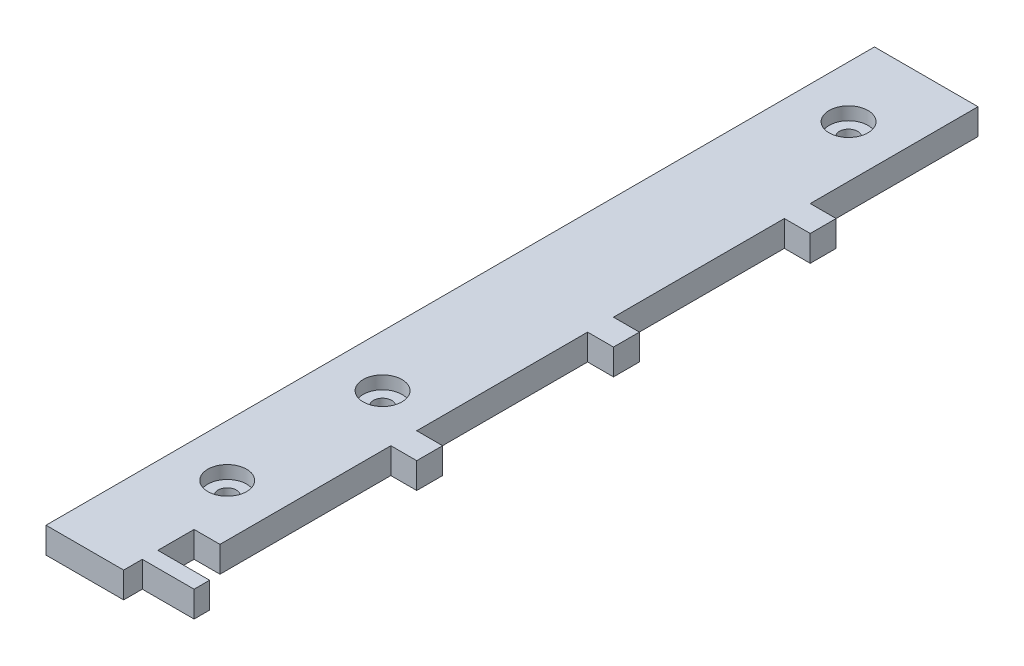
ISO-10303-21;
HEADER;
FILE_DESCRIPTION(('STEP AP214'),'2;1');
FILE_NAME('part.step','',(''),(''),'','','');
FILE_SCHEMA(('AUTOMOTIVE_DESIGN { 1 0 10303 214 1 1 1 1 }'));
ENDSEC;
DATA;
#1=APPLICATION_CONTEXT('core data for automotive mechanical design processes');
#2=APPLICATION_PROTOCOL_DEFINITION('international standard','automotive_design',2000,#1);
#3=PRODUCT_CONTEXT('',#1,'mechanical');
#4=PRODUCT('Part','Part','',(#3));
#5=PRODUCT_RELATED_PRODUCT_CATEGORY('part','',(#4));
#6=PRODUCT_DEFINITION_FORMATION('','',#4);
#7=PRODUCT_DEFINITION_CONTEXT('part definition',#1,'design');
#8=PRODUCT_DEFINITION('design','',#6,#7);
#9=PRODUCT_DEFINITION_SHAPE('','',#8);
#10=(LENGTH_UNIT() NAMED_UNIT(*) SI_UNIT(.MILLI.,.METRE.));
#11=(NAMED_UNIT(*) PLANE_ANGLE_UNIT() SI_UNIT($,.RADIAN.));
#12=(NAMED_UNIT(*) SI_UNIT($,.STERADIAN.) SOLID_ANGLE_UNIT());
#13=UNCERTAINTY_MEASURE_WITH_UNIT(LENGTH_MEASURE(1.E-05),#10,'distance_accuracy_value','');
#14=(GEOMETRIC_REPRESENTATION_CONTEXT(3) GLOBAL_UNCERTAINTY_ASSIGNED_CONTEXT((#13)) GLOBAL_UNIT_ASSIGNED_CONTEXT((#10,
#11,#12)) REPRESENTATION_CONTEXT('',''));
#15=CARTESIAN_POINT('',(0.,0.,0.));
#16=DIRECTION('',(0.,0.,1.));
#17=DIRECTION('',(1.,0.,0.));
#18=AXIS2_PLACEMENT_3D('',#15,#16,#17);
#19=CARTESIAN_POINT('',(0.,6.35,0.));
#20=DIRECTION('',(0.,-1.,0.));
#21=DIRECTION('',(0.,0.,-1.));
#22=AXIS2_PLACEMENT_3D('',#19,#20,#21);
#23=PLANE('',#22);
#24=CARTESIAN_POINT('',(12.7,6.35,-31.75));
#25=DIRECTION('',(0.,1.,0.));
#26=DIRECTION('',(0.,0.,1.));
#27=AXIS2_PLACEMENT_3D('',#24,#25,#26);
#28=CIRCLE('',#27,4.76249999999999);
#29=CARTESIAN_POINT('',(12.7,6.35,-26.9875));
#30=VERTEX_POINT('',#29);
#31=EDGE_CURVE('E387',#30,#30,#28,.T.);
#32=ORIENTED_EDGE('',*,*,#31,.F.);
#33=EDGE_LOOP('',(#32));
#34=FACE_BOUND('',#33,.T.);
#35=CARTESIAN_POINT('',(12.7,6.35,-69.85));
#36=DIRECTION('',(0.,1.,0.));
#37=DIRECTION('',(0.,0.,1.));
#38=AXIS2_PLACEMENT_3D('',#35,#36,#37);
#39=CIRCLE('',#38,4.76249999999999);
#40=CARTESIAN_POINT('',(12.7,6.35,-65.0875));
#41=VERTEX_POINT('',#40);
#42=EDGE_CURVE('E375',#41,#41,#39,.T.);
#43=ORIENTED_EDGE('',*,*,#42,.F.);
#44=EDGE_LOOP('',(#43));
#45=FACE_BOUND('',#44,.T.);
#46=DIRECTION('',(0.,0.,-1.));
#47=VECTOR('',#46,1.);
#48=CARTESIAN_POINT('',(19.05,6.35,0.));
#49=LINE('',#48,#47);
#50=CARTESIAN_POINT('',(19.05,6.35,0.));
#51=VERTEX_POINT('',#50);
#52=CARTESIAN_POINT('',(19.05,6.35,-4.572));
#53=VERTEX_POINT('',#52);
#54=EDGE_CURVE('E188',#51,#53,#49,.T.);
#55=ORIENTED_EDGE('',*,*,#54,.T.);
#56=DIRECTION('',(-1.,0.,0.));
#57=VECTOR('',#56,1.);
#58=CARTESIAN_POINT('',(0.,6.35,-4.572));
#59=LINE('',#58,#57);
#60=CARTESIAN_POINT('',(31.75,6.35,-4.572));
#61=VERTEX_POINT('',#60);
#62=EDGE_CURVE('E200',#61,#53,#59,.T.);
#63=ORIENTED_EDGE('',*,*,#62,.F.);
#64=DIRECTION('',(0.,0.,-1.));
#65=VECTOR('',#64,1.);
#66=CARTESIAN_POINT('',(31.75,6.35,0.));
#67=LINE('',#66,#65);
#68=CARTESIAN_POINT('',(31.75,6.35,-8.382));
#69=VERTEX_POINT('',#68);
#70=EDGE_CURVE('E222',#61,#69,#67,.T.);
#71=ORIENTED_EDGE('',*,*,#70,.T.);
#72=DIRECTION('',(-1.,0.,0.));
#73=VECTOR('',#72,1.);
#74=CARTESIAN_POINT('',(31.75,6.35,-8.382));
#75=LINE('',#74,#73);
#76=CARTESIAN_POINT('',(19.05,6.35,-8.382));
#77=VERTEX_POINT('',#76);
#78=EDGE_CURVE('E260',#69,#77,#75,.T.);
#79=ORIENTED_EDGE('',*,*,#78,.T.);
#80=DIRECTION('',(0.,0.,-1.));
#81=VECTOR('',#80,1.);
#82=CARTESIAN_POINT('',(19.05,6.35,-8.382));
#83=LINE('',#82,#81);
#84=CARTESIAN_POINT('',(19.05,6.35,-17.272));
#85=VERTEX_POINT('',#84);
#86=EDGE_CURVE('E270',#77,#85,#83,.T.);
#87=ORIENTED_EDGE('',*,*,#86,.T.);
#88=DIRECTION('',(-1.,0.,0.));
#89=VECTOR('',#88,1.);
#90=CARTESIAN_POINT('',(31.75,6.35,-17.272));
#91=LINE('',#90,#89);
#92=CARTESIAN_POINT('',(25.4,6.35,-17.272));
#93=VERTEX_POINT('',#92);
#94=EDGE_CURVE('E267',#93,#85,#91,.T.);
#95=ORIENTED_EDGE('',*,*,#94,.F.);
#96=DIRECTION('',(0.,0.,1.));
#97=VECTOR('',#96,1.);
#98=CARTESIAN_POINT('',(25.4,6.35,0.));
#99=LINE('',#98,#97);
#100=CARTESIAN_POINT('',(25.4,6.35,-59.182));
#101=VERTEX_POINT('',#100);
#102=EDGE_CURVE('E240',#101,#93,#99,.T.);
#103=ORIENTED_EDGE('',*,*,#102,.F.);
#104=DIRECTION('',(-1.,0.,0.));
#105=VECTOR('',#104,1.);
#106=CARTESIAN_POINT('',(0.,6.35,-59.182));
#107=LINE('',#106,#105);
#108=CARTESIAN_POINT('',(31.75,6.35,-59.182));
#109=VERTEX_POINT('',#108);
#110=EDGE_CURVE('E245',#109,#101,#107,.T.);
#111=ORIENTED_EDGE('',*,*,#110,.F.);
#112=CARTESIAN_POINT('',(31.75,6.35,-65.532));
#113=VERTEX_POINT('',#112);
#114=EDGE_CURVE('E228',#109,#113,#67,.T.);
#115=ORIENTED_EDGE('',*,*,#114,.T.);
#116=DIRECTION('',(-1.,0.,0.));
#117=VECTOR('',#116,1.);
#118=CARTESIAN_POINT('',(0.,6.35,-65.532));
#119=LINE('',#118,#117);
#120=CARTESIAN_POINT('',(25.4,6.35,-65.532));
#121=VERTEX_POINT('',#120);
#122=EDGE_CURVE('E284',#113,#121,#119,.T.);
#123=ORIENTED_EDGE('',*,*,#122,.T.);
#124=DIRECTION('',(0.,0.,1.));
#125=VECTOR('',#124,1.);
#126=CARTESIAN_POINT('',(25.4,6.35,0.));
#127=LINE('',#126,#125);
#128=CARTESIAN_POINT('',(25.4,6.35,-107.442));
#129=VERTEX_POINT('',#128);
#130=EDGE_CURVE('E296',#129,#121,#127,.T.);
#131=ORIENTED_EDGE('',*,*,#130,.F.);
#132=DIRECTION('',(-1.,0.,0.));
#133=VECTOR('',#132,1.);
#134=CARTESIAN_POINT('',(0.,6.35,-107.442));
#135=LINE('',#134,#133);
#136=CARTESIAN_POINT('',(31.75,6.35,-107.442));
#137=VERTEX_POINT('',#136);
#138=EDGE_CURVE('E292',#137,#129,#135,.T.);
#139=ORIENTED_EDGE('',*,*,#138,.F.);
#140=CARTESIAN_POINT('',(31.75,6.35,-113.792));
#141=VERTEX_POINT('',#140);
#142=EDGE_CURVE('E233',#137,#141,#67,.T.);
#143=ORIENTED_EDGE('',*,*,#142,.T.);
#144=DIRECTION('',(-1.,0.,0.));
#145=VECTOR('',#144,1.);
#146=CARTESIAN_POINT('',(31.75,6.35,-113.792));
#147=LINE('',#146,#145);
#148=CARTESIAN_POINT('',(25.4,6.35,-113.792));
#149=VERTEX_POINT('',#148);
#150=EDGE_CURVE('E330',#141,#149,#147,.T.);
#151=ORIENTED_EDGE('',*,*,#150,.T.);
#152=DIRECTION('',(0.,0.,1.));
#153=VECTOR('',#152,1.);
#154=CARTESIAN_POINT('',(25.4,6.35,-155.702));
#155=LINE('',#154,#153);
#156=CARTESIAN_POINT('',(25.4,6.35,-155.702));
#157=VERTEX_POINT('',#156);
#158=EDGE_CURVE('E340',#157,#149,#155,.T.);
#159=ORIENTED_EDGE('',*,*,#158,.F.);
#160=DIRECTION('',(-1.,0.,0.));
#161=VECTOR('',#160,1.);
#162=CARTESIAN_POINT('',(31.75,6.35,-155.702));
#163=LINE('',#162,#161);
#164=CARTESIAN_POINT('',(31.75,6.35,-155.702));
#165=VERTEX_POINT('',#164);
#166=EDGE_CURVE('E337',#165,#157,#163,.T.);
#167=ORIENTED_EDGE('',*,*,#166,.F.);
#168=CARTESIAN_POINT('',(31.75,6.35,-162.052));
#169=VERTEX_POINT('',#168);
#170=EDGE_CURVE('E230',#165,#169,#67,.T.);
#171=ORIENTED_EDGE('',*,*,#170,.T.);
#172=DIRECTION('',(-1.,0.,0.));
#173=VECTOR('',#172,1.);
#174=CARTESIAN_POINT('',(0.,6.35,-162.052));
#175=LINE('',#174,#173);
#176=CARTESIAN_POINT('',(25.4,6.35,-162.052));
#177=VERTEX_POINT('',#176);
#178=EDGE_CURVE('E311',#169,#177,#175,.T.);
#179=ORIENTED_EDGE('',*,*,#178,.T.);
#180=DIRECTION('',(0.,0.,1.));
#181=VECTOR('',#180,1.);
#182=CARTESIAN_POINT('',(25.4,6.35,0.));
#183=LINE('',#182,#181);
#184=CARTESIAN_POINT('',(25.4,6.35,-203.2));
#185=VERTEX_POINT('',#184);
#186=EDGE_CURVE('E316',#185,#177,#183,.T.);
#187=ORIENTED_EDGE('',*,*,#186,.F.);
#188=DIRECTION('',(-1.,0.,0.));
#189=VECTOR('',#188,1.);
#190=CARTESIAN_POINT('',(0.,6.35,-203.2));
#191=LINE('',#190,#189);
#192=CARTESIAN_POINT('',(0.,6.35,-203.2));
#193=VERTEX_POINT('',#192);
#194=EDGE_CURVE('E218',#185,#193,#191,.T.);
#195=ORIENTED_EDGE('',*,*,#194,.T.);
#196=DIRECTION('',(0.,0.,1.));
#197=VECTOR('',#196,1.);
#198=CARTESIAN_POINT('',(0.,6.35,0.));
#199=LINE('',#198,#197);
#200=CARTESIAN_POINT('',(0.,6.35,0.));
#201=VERTEX_POINT('',#200);
#202=EDGE_CURVE('E216',#193,#201,#199,.T.);
#203=ORIENTED_EDGE('',*,*,#202,.T.);
#204=DIRECTION('',(1.,0.,0.));
#205=VECTOR('',#204,1.);
#206=CARTESIAN_POINT('',(0.,6.35,0.));
#207=LINE('',#206,#205);
#208=EDGE_CURVE('E234',#201,#51,#207,.T.);
#209=ORIENTED_EDGE('',*,*,#208,.T.);
#210=EDGE_LOOP('',(#55,#63,#71,#79,#87,#95,#103,#111,#115,#123,#131,#139,#143,#151,#159,#167,
#171,#179,#187,#195,#203,#209));
#211=FACE_BOUND('',#210,.T.);
#212=CARTESIAN_POINT('',(12.7,6.35,-184.15));
#213=DIRECTION('',(0.,1.,0.));
#214=DIRECTION('',(0.,0.,1.));
#215=AXIS2_PLACEMENT_3D('',#212,#213,#214);
#216=CIRCLE('',#215,4.76249999999999);
#217=CARTESIAN_POINT('',(12.7,6.35,-179.3875));
#218=VERTEX_POINT('',#217);
#219=EDGE_CURVE('E363',#218,#218,#216,.T.);
#220=ORIENTED_EDGE('',*,*,#219,.F.);
#221=EDGE_LOOP('',(#220));
#222=FACE_BOUND('',#221,.T.);
#223=ADVANCED_FACE('F33',(#34,#45,#211,#222),#23,.F.);
#224=CARTESIAN_POINT('',(0.,6.35,0.));
#225=DIRECTION('',(0.,0.,-1.));
#226=DIRECTION('',(-1.,0.,0.));
#227=AXIS2_PLACEMENT_3D('',#224,#225,#226);
#228=PLANE('',#227);
#229=DIRECTION('',(0.,1.,0.));
#230=VECTOR('',#229,1.);
#231=CARTESIAN_POINT('',(19.05,0.,0.));
#232=LINE('',#231,#230);
#233=CARTESIAN_POINT('',(19.05,0.,0.));
#234=VERTEX_POINT('',#233);
#235=EDGE_CURVE('E182',#234,#51,#232,.T.);
#236=ORIENTED_EDGE('',*,*,#235,.T.);
#237=ORIENTED_EDGE('',*,*,#208,.F.);
#238=DIRECTION('',(0.,-1.,0.));
#239=VECTOR('',#238,1.);
#240=CARTESIAN_POINT('',(0.,6.35,0.));
#241=LINE('',#240,#239);
#242=CARTESIAN_POINT('',(0.,0.,0.));
#243=VERTEX_POINT('',#242);
#244=EDGE_CURVE('E11',#201,#243,#241,.T.);
#245=ORIENTED_EDGE('',*,*,#244,.T.);
#246=DIRECTION('',(1.,0.,0.));
#247=VECTOR('',#246,1.);
#248=CARTESIAN_POINT('',(0.,0.,0.));
#249=LINE('',#248,#247);
#250=EDGE_CURVE('E198',#243,#234,#249,.T.);
#251=ORIENTED_EDGE('',*,*,#250,.T.);
#252=EDGE_LOOP('',(#236,#237,#245,#251));
#253=FACE_BOUND('',#252,.T.);
#254=ADVANCED_FACE('F202',(#253),#228,.F.);
#255=CARTESIAN_POINT('',(31.75,6.35,0.));
#256=DIRECTION('',(-1.,0.,0.));
#257=DIRECTION('',(0.,0.,1.));
#258=AXIS2_PLACEMENT_3D('',#255,#256,#257);
#259=PLANE('',#258);
#260=DIRECTION('',(0.,1.,0.));
#261=VECTOR('',#260,1.);
#262=CARTESIAN_POINT('',(31.75,0.,-113.792));
#263=LINE('',#262,#261);
#264=CARTESIAN_POINT('',(31.75,0.,-113.792));
#265=VERTEX_POINT('',#264);
#266=EDGE_CURVE('E345',#265,#141,#263,.T.);
#267=ORIENTED_EDGE('',*,*,#266,.T.);
#268=ORIENTED_EDGE('',*,*,#142,.F.);
#269=DIRECTION('',(0.,1.,0.));
#270=VECTOR('',#269,1.);
#271=CARTESIAN_POINT('',(31.75,0.,-107.442));
#272=LINE('',#271,#270);
#273=CARTESIAN_POINT('',(31.75,0.,-107.442));
#274=VERTEX_POINT('',#273);
#275=EDGE_CURVE('E269',#274,#137,#272,.T.);
#276=ORIENTED_EDGE('',*,*,#275,.F.);
#277=DIRECTION('',(0.,0.,-1.));
#278=VECTOR('',#277,1.);
#279=CARTESIAN_POINT('',(31.75,0.,0.));
#280=LINE('',#279,#278);
#281=EDGE_CURVE('E209',#274,#265,#280,.T.);
#282=ORIENTED_EDGE('',*,*,#281,.T.);
#283=EDGE_LOOP('',(#267,#268,#276,#282));
#284=FACE_BOUND('',#283,.T.);
#285=ADVANCED_FACE('F487',(#284),#259,.F.);
#286=ORIENTED_EDGE('',*,*,#170,.F.);
#287=DIRECTION('',(0.,1.,0.));
#288=VECTOR('',#287,1.);
#289=CARTESIAN_POINT('',(31.75,0.,-155.702));
#290=LINE('',#289,#288);
#291=CARTESIAN_POINT('',(31.75,0.,-155.702));
#292=VERTEX_POINT('',#291);
#293=EDGE_CURVE('E319',#292,#165,#290,.T.);
#294=ORIENTED_EDGE('',*,*,#293,.F.);
#295=CARTESIAN_POINT('',(31.75,0.,-162.052));
#296=VERTEX_POINT('',#295);
#297=EDGE_CURVE('E205',#292,#296,#280,.T.);
#298=ORIENTED_EDGE('',*,*,#297,.T.);
#299=DIRECTION('',(0.,1.,0.));
#300=VECTOR('',#299,1.);
#301=CARTESIAN_POINT('',(31.75,0.,-162.052));
#302=LINE('',#301,#300);
#303=EDGE_CURVE('E295',#296,#169,#302,.T.);
#304=ORIENTED_EDGE('',*,*,#303,.T.);
#305=EDGE_LOOP('',(#286,#294,#298,#304));
#306=FACE_BOUND('',#305,.T.);
#307=ADVANCED_FACE('F489',(#306),#259,.F.);
#308=DIRECTION('',(0.,1.,0.));
#309=VECTOR('',#308,1.);
#310=CARTESIAN_POINT('',(31.75,0.,-65.532));
#311=LINE('',#310,#309);
#312=CARTESIAN_POINT('',(31.75,0.,-65.532));
#313=VERTEX_POINT('',#312);
#314=EDGE_CURVE('E302',#313,#113,#311,.T.);
#315=ORIENTED_EDGE('',*,*,#314,.T.);
#316=ORIENTED_EDGE('',*,*,#114,.F.);
#317=DIRECTION('',(0.,1.,0.));
#318=VECTOR('',#317,1.);
#319=CARTESIAN_POINT('',(31.75,0.,-59.182));
#320=LINE('',#319,#318);
#321=CARTESIAN_POINT('',(31.75,0.,-59.182));
#322=VERTEX_POINT('',#321);
#323=EDGE_CURVE('E251',#322,#109,#320,.T.);
#324=ORIENTED_EDGE('',*,*,#323,.F.);
#325=EDGE_CURVE('E745',#322,#313,#280,.T.);
#326=ORIENTED_EDGE('',*,*,#325,.T.);
#327=EDGE_LOOP('',(#315,#316,#324,#326));
#328=FACE_BOUND('',#327,.T.);
#329=ADVANCED_FACE('F505',(#328),#259,.F.);
#330=ORIENTED_EDGE('',*,*,#70,.F.);
#331=DIRECTION('',(0.,1.,0.));
#332=VECTOR('',#331,1.);
#333=CARTESIAN_POINT('',(31.75,0.,-4.572));
#334=LINE('',#333,#332);
#335=CARTESIAN_POINT('',(31.75,0.,-4.572));
#336=VERTEX_POINT('',#335);
#337=EDGE_CURVE('E192',#336,#61,#334,.T.);
#338=ORIENTED_EDGE('',*,*,#337,.F.);
#339=CARTESIAN_POINT('',(31.75,0.,-8.382));
#340=VERTEX_POINT('',#339);
#341=EDGE_CURVE('E211',#336,#340,#280,.T.);
#342=ORIENTED_EDGE('',*,*,#341,.T.);
#343=DIRECTION('',(0.,1.,0.));
#344=VECTOR('',#343,1.);
#345=CARTESIAN_POINT('',(31.75,0.,-8.382));
#346=LINE('',#345,#344);
#347=EDGE_CURVE('E248',#340,#69,#346,.T.);
#348=ORIENTED_EDGE('',*,*,#347,.T.);
#349=EDGE_LOOP('',(#330,#338,#342,#348));
#350=FACE_BOUND('',#349,.T.);
#351=ADVANCED_FACE('F482',(#350),#259,.F.);
#352=CARTESIAN_POINT('',(0.,0.,0.));
#353=DIRECTION('',(0.,-1.,0.));
#354=DIRECTION('',(0.,0.,-1.));
#355=AXIS2_PLACEMENT_3D('',#352,#353,#354);
#356=PLANE('',#355);
#357=CARTESIAN_POINT('',(12.7,0.,-31.75));
#358=DIRECTION('',(0.,1.,0.));
#359=DIRECTION('',(0.,0.,1.));
#360=AXIS2_PLACEMENT_3D('',#357,#358,#359);
#361=CIRCLE('',#360,2.24790000000001);
#362=CARTESIAN_POINT('',(12.7,0.,-29.5021));
#363=VERTEX_POINT('',#362);
#364=EDGE_CURVE('E378',#363,#363,#361,.T.);
#365=ORIENTED_EDGE('',*,*,#364,.T.);
#366=EDGE_LOOP('',(#365));
#367=FACE_BOUND('',#366,.T.);
#368=CARTESIAN_POINT('',(12.7,0.,-69.85));
#369=DIRECTION('',(0.,1.,0.));
#370=DIRECTION('',(0.,0.,1.));
#371=AXIS2_PLACEMENT_3D('',#368,#369,#370);
#372=CIRCLE('',#371,2.24790000000001);
#373=CARTESIAN_POINT('',(12.7,0.,-67.6021));
#374=VERTEX_POINT('',#373);
#375=EDGE_CURVE('E366',#374,#374,#372,.T.);
#376=ORIENTED_EDGE('',*,*,#375,.T.);
#377=EDGE_LOOP('',(#376));
#378=FACE_BOUND('',#377,.T.);
#379=CARTESIAN_POINT('',(12.7,0.,-184.15));
#380=DIRECTION('',(0.,1.,0.));
#381=DIRECTION('',(0.,0.,1.));
#382=AXIS2_PLACEMENT_3D('',#379,#380,#381);
#383=CIRCLE('',#382,2.24790000000001);
#384=CARTESIAN_POINT('',(12.7,0.,-181.9021));
#385=VERTEX_POINT('',#384);
#386=EDGE_CURVE('E254',#385,#385,#383,.T.);
#387=ORIENTED_EDGE('',*,*,#386,.T.);
#388=EDGE_LOOP('',(#387));
#389=FACE_BOUND('',#388,.T.);
#390=DIRECTION('',(-1.,0.,0.));
#391=VECTOR('',#390,1.);
#392=CARTESIAN_POINT('',(0.,0.,-4.572));
#393=LINE('',#392,#391);
#394=CARTESIAN_POINT('',(19.05,0.,-4.572));
#395=VERTEX_POINT('',#394);
#396=EDGE_CURVE('E193',#336,#395,#393,.T.);
#397=ORIENTED_EDGE('',*,*,#396,.T.);
#398=DIRECTION('',(0.,0.,-1.));
#399=VECTOR('',#398,1.);
#400=CARTESIAN_POINT('',(19.05,0.,0.));
#401=LINE('',#400,#399);
#402=EDGE_CURVE('E185',#234,#395,#401,.T.);
#403=ORIENTED_EDGE('',*,*,#402,.F.);
#404=ORIENTED_EDGE('',*,*,#250,.F.);
#405=DIRECTION('',(0.,0.,1.));
#406=VECTOR('',#405,1.);
#407=CARTESIAN_POINT('',(0.,0.,0.));
#408=LINE('',#407,#406);
#409=CARTESIAN_POINT('',(0.,0.,-203.2));
#410=VERTEX_POINT('',#409);
#411=EDGE_CURVE('E206',#410,#243,#408,.T.);
#412=ORIENTED_EDGE('',*,*,#411,.F.);
#413=DIRECTION('',(-1.,0.,0.));
#414=VECTOR('',#413,1.);
#415=CARTESIAN_POINT('',(0.,0.,-203.2));
#416=LINE('',#415,#414);
#417=CARTESIAN_POINT('',(25.4,0.,-203.2));
#418=VERTEX_POINT('',#417);
#419=EDGE_CURVE('E215',#418,#410,#416,.T.);
#420=ORIENTED_EDGE('',*,*,#419,.F.);
#421=DIRECTION('',(0.,0.,1.));
#422=VECTOR('',#421,1.);
#423=CARTESIAN_POINT('',(25.4,0.,0.));
#424=LINE('',#423,#422);
#425=CARTESIAN_POINT('',(25.4,0.,-162.052));
#426=VERTEX_POINT('',#425);
#427=EDGE_CURVE('E308',#418,#426,#424,.T.);
#428=ORIENTED_EDGE('',*,*,#427,.T.);
#429=DIRECTION('',(-1.,0.,0.));
#430=VECTOR('',#429,1.);
#431=CARTESIAN_POINT('',(0.,0.,-162.052));
#432=LINE('',#431,#430);
#433=EDGE_CURVE('E312',#296,#426,#432,.T.);
#434=ORIENTED_EDGE('',*,*,#433,.F.);
#435=ORIENTED_EDGE('',*,*,#297,.F.);
#436=DIRECTION('',(-1.,0.,0.));
#437=VECTOR('',#436,1.);
#438=CARTESIAN_POINT('',(31.75,0.,-155.702));
#439=LINE('',#438,#437);
#440=CARTESIAN_POINT('',(25.4,0.,-155.702));
#441=VERTEX_POINT('',#440);
#442=EDGE_CURVE('E327',#292,#441,#439,.T.);
#443=ORIENTED_EDGE('',*,*,#442,.T.);
#444=DIRECTION('',(0.,0.,1.));
#445=VECTOR('',#444,1.);
#446=CARTESIAN_POINT('',(25.4,0.,-155.702));
#447=LINE('',#446,#445);
#448=CARTESIAN_POINT('',(25.4,0.,-113.792));
#449=VERTEX_POINT('',#448);
#450=EDGE_CURVE('E331',#441,#449,#447,.T.);
#451=ORIENTED_EDGE('',*,*,#450,.T.);
#452=DIRECTION('',(-1.,0.,0.));
#453=VECTOR('',#452,1.);
#454=CARTESIAN_POINT('',(31.75,0.,-113.792));
#455=LINE('',#454,#453);
#456=EDGE_CURVE('E334',#265,#449,#455,.T.);
#457=ORIENTED_EDGE('',*,*,#456,.F.);
#458=ORIENTED_EDGE('',*,*,#281,.F.);
#459=DIRECTION('',(-1.,0.,0.));
#460=VECTOR('',#459,1.);
#461=CARTESIAN_POINT('',(0.,0.,-107.442));
#462=LINE('',#461,#460);
#463=CARTESIAN_POINT('',(25.4,0.,-107.442));
#464=VERTEX_POINT('',#463);
#465=EDGE_CURVE('E281',#274,#464,#462,.T.);
#466=ORIENTED_EDGE('',*,*,#465,.T.);
#467=DIRECTION('',(0.,0.,1.));
#468=VECTOR('',#467,1.);
#469=CARTESIAN_POINT('',(25.4,0.,0.));
#470=LINE('',#469,#468);
#471=CARTESIAN_POINT('',(25.4,0.,-65.532));
#472=VERTEX_POINT('',#471);
#473=EDGE_CURVE('E285',#464,#472,#470,.T.);
#474=ORIENTED_EDGE('',*,*,#473,.T.);
#475=DIRECTION('',(-1.,0.,0.));
#476=VECTOR('',#475,1.);
#477=CARTESIAN_POINT('',(0.,0.,-65.532));
#478=LINE('',#477,#476);
#479=EDGE_CURVE('E288',#313,#472,#478,.T.);
#480=ORIENTED_EDGE('',*,*,#479,.F.);
#481=ORIENTED_EDGE('',*,*,#325,.F.);
#482=DIRECTION('',(-1.,0.,0.));
#483=VECTOR('',#482,1.);
#484=CARTESIAN_POINT('',(0.,0.,-59.182));
#485=LINE('',#484,#483);
#486=CARTESIAN_POINT('',(25.4,0.,-59.182));
#487=VERTEX_POINT('',#486);
#488=EDGE_CURVE('E237',#322,#487,#485,.T.);
#489=ORIENTED_EDGE('',*,*,#488,.T.);
#490=DIRECTION('',(0.,0.,1.));
#491=VECTOR('',#490,1.);
#492=CARTESIAN_POINT('',(25.4,0.,0.));
#493=LINE('',#492,#491);
#494=CARTESIAN_POINT('',(25.4,0.,-17.272));
#495=VERTEX_POINT('',#494);
#496=EDGE_CURVE('E241',#487,#495,#493,.T.);
#497=ORIENTED_EDGE('',*,*,#496,.T.);
#498=DIRECTION('',(-1.,0.,0.));
#499=VECTOR('',#498,1.);
#500=CARTESIAN_POINT('',(31.75,0.,-17.272));
#501=LINE('',#500,#499);
#502=CARTESIAN_POINT('',(19.05,0.,-17.272));
#503=VERTEX_POINT('',#502);
#504=EDGE_CURVE('E257',#495,#503,#501,.T.);
#505=ORIENTED_EDGE('',*,*,#504,.T.);
#506=DIRECTION('',(0.,0.,-1.));
#507=VECTOR('',#506,1.);
#508=CARTESIAN_POINT('',(19.05,0.,-8.382));
#509=LINE('',#508,#507);
#510=CARTESIAN_POINT('',(19.05,0.,-8.382));
#511=VERTEX_POINT('',#510);
#512=EDGE_CURVE('E261',#511,#503,#509,.T.);
#513=ORIENTED_EDGE('',*,*,#512,.F.);
#514=DIRECTION('',(-1.,0.,0.));
#515=VECTOR('',#514,1.);
#516=CARTESIAN_POINT('',(31.75,0.,-8.382));
#517=LINE('',#516,#515);
#518=EDGE_CURVE('E264',#340,#511,#517,.T.);
#519=ORIENTED_EDGE('',*,*,#518,.F.);
#520=ORIENTED_EDGE('',*,*,#341,.F.);
#521=EDGE_LOOP('',(#397,#403,#404,#412,#420,#428,#434,#435,#443,#451,#457,#458,#466,#474,#480,
#481,#489,#497,#505,#513,#519,#520));
#522=FACE_BOUND('',#521,.T.);
#523=ADVANCED_FACE('F196',(#367,#378,#389,#522),#356,.T.);
#524=CARTESIAN_POINT('',(0.,6.35,0.));
#525=DIRECTION('',(1.,0.,0.));
#526=DIRECTION('',(0.,0.,-1.));
#527=AXIS2_PLACEMENT_3D('',#524,#525,#526);
#528=PLANE('',#527);
#529=ORIENTED_EDGE('',*,*,#411,.T.);
#530=ORIENTED_EDGE('',*,*,#244,.F.);
#531=ORIENTED_EDGE('',*,*,#202,.F.);
#532=DIRECTION('',(0.,-1.,0.));
#533=VECTOR('',#532,1.);
#534=CARTESIAN_POINT('',(0.,6.35,-203.2));
#535=LINE('',#534,#533);
#536=EDGE_CURVE('E41',#193,#410,#535,.T.);
#537=ORIENTED_EDGE('',*,*,#536,.T.);
#538=EDGE_LOOP('',(#529,#530,#531,#537));
#539=FACE_BOUND('',#538,.T.);
#540=ADVANCED_FACE('F35',(#539),#528,.F.);
#541=CARTESIAN_POINT('',(0.,6.35,-203.2));
#542=DIRECTION('',(0.,0.,1.));
#543=DIRECTION('',(1.,0.,0.));
#544=AXIS2_PLACEMENT_3D('',#541,#542,#543);
#545=PLANE('',#544);
#546=ORIENTED_EDGE('',*,*,#194,.F.);
#547=DIRECTION('',(0.,1.,0.));
#548=VECTOR('',#547,1.);
#549=CARTESIAN_POINT('',(25.4,0.,-203.2));
#550=LINE('',#549,#548);
#551=EDGE_CURVE('E315',#418,#185,#550,.T.);
#552=ORIENTED_EDGE('',*,*,#551,.F.);
#553=ORIENTED_EDGE('',*,*,#419,.T.);
#554=ORIENTED_EDGE('',*,*,#536,.F.);
#555=EDGE_LOOP('',(#546,#552,#553,#554));
#556=FACE_BOUND('',#555,.T.);
#557=ADVANCED_FACE('F475',(#556),#545,.F.);
#558=CARTESIAN_POINT('',(0.,0.,-59.182));
#559=DIRECTION('',(0.,0.,-1.));
#560=DIRECTION('',(-1.,0.,0.));
#561=AXIS2_PLACEMENT_3D('',#558,#559,#560);
#562=PLANE('',#561);
#563=ORIENTED_EDGE('',*,*,#110,.T.);
#564=DIRECTION('',(0.,1.,0.));
#565=VECTOR('',#564,1.);
#566=CARTESIAN_POINT('',(25.4,0.,-59.182));
#567=LINE('',#566,#565);
#568=EDGE_CURVE('E244',#487,#101,#567,.T.);
#569=ORIENTED_EDGE('',*,*,#568,.F.);
#570=ORIENTED_EDGE('',*,*,#488,.F.);
#571=ORIENTED_EDGE('',*,*,#323,.T.);
#572=EDGE_LOOP('',(#563,#569,#570,#571));
#573=FACE_BOUND('',#572,.T.);
#574=ADVANCED_FACE('F472',(#573),#562,.F.);
#575=CARTESIAN_POINT('',(25.4,0.,0.));
#576=DIRECTION('',(-1.,0.,0.));
#577=DIRECTION('',(0.,0.,1.));
#578=AXIS2_PLACEMENT_3D('',#575,#576,#577);
#579=PLANE('',#578);
#580=ORIENTED_EDGE('',*,*,#102,.T.);
#581=DIRECTION('',(0.,1.,0.));
#582=VECTOR('',#581,1.);
#583=CARTESIAN_POINT('',(25.4,0.,-17.272));
#584=LINE('',#583,#582);
#585=EDGE_CURVE('E253',#495,#93,#584,.T.);
#586=ORIENTED_EDGE('',*,*,#585,.F.);
#587=ORIENTED_EDGE('',*,*,#496,.F.);
#588=ORIENTED_EDGE('',*,*,#568,.T.);
#589=EDGE_LOOP('',(#580,#586,#587,#588));
#590=FACE_BOUND('',#589,.T.);
#591=ADVANCED_FACE('F465',(#590),#579,.F.);
#592=CARTESIAN_POINT('',(31.75,0.,-8.382));
#593=DIRECTION('',(0.,0.,-1.));
#594=DIRECTION('',(-1.,0.,0.));
#595=AXIS2_PLACEMENT_3D('',#592,#593,#594);
#596=PLANE('',#595);
#597=ORIENTED_EDGE('',*,*,#78,.F.);
#598=ORIENTED_EDGE('',*,*,#347,.F.);
#599=ORIENTED_EDGE('',*,*,#518,.T.);
#600=DIRECTION('',(0.,1.,0.));
#601=VECTOR('',#600,1.);
#602=CARTESIAN_POINT('',(19.05,0.,-8.382));
#603=LINE('',#602,#601);
#604=EDGE_CURVE('E277',#511,#77,#603,.T.);
#605=ORIENTED_EDGE('',*,*,#604,.T.);
#606=EDGE_LOOP('',(#597,#598,#599,#605));
#607=FACE_BOUND('',#606,.T.);
#608=ADVANCED_FACE('F464',(#607),#596,.T.);
#609=CARTESIAN_POINT('',(19.05,0.,-8.382));
#610=DIRECTION('',(1.,0.,0.));
#611=DIRECTION('',(0.,0.,-1.));
#612=AXIS2_PLACEMENT_3D('',#609,#610,#611);
#613=PLANE('',#612);
#614=ORIENTED_EDGE('',*,*,#86,.F.);
#615=ORIENTED_EDGE('',*,*,#604,.F.);
#616=ORIENTED_EDGE('',*,*,#512,.T.);
#617=DIRECTION('',(0.,1.,0.));
#618=VECTOR('',#617,1.);
#619=CARTESIAN_POINT('',(19.05,0.,-17.272));
#620=LINE('',#619,#618);
#621=EDGE_CURVE('E266',#503,#85,#620,.T.);
#622=ORIENTED_EDGE('',*,*,#621,.T.);
#623=EDGE_LOOP('',(#614,#615,#616,#622));
#624=FACE_BOUND('',#623,.T.);
#625=ADVANCED_FACE('F454',(#624),#613,.T.);
#626=CARTESIAN_POINT('',(31.75,0.,-17.272));
#627=DIRECTION('',(0.,0.,-1.));
#628=DIRECTION('',(-1.,0.,0.));
#629=AXIS2_PLACEMENT_3D('',#626,#627,#628);
#630=PLANE('',#629);
#631=ORIENTED_EDGE('',*,*,#585,.T.);
#632=ORIENTED_EDGE('',*,*,#94,.T.);
#633=ORIENTED_EDGE('',*,*,#621,.F.);
#634=ORIENTED_EDGE('',*,*,#504,.F.);
#635=EDGE_LOOP('',(#631,#632,#633,#634));
#636=FACE_BOUND('',#635,.T.);
#637=ADVANCED_FACE('F452',(#636),#630,.F.);
#638=CARTESIAN_POINT('',(0.,0.,-107.442));
#639=DIRECTION('',(0.,0.,-1.));
#640=DIRECTION('',(-1.,0.,0.));
#641=AXIS2_PLACEMENT_3D('',#638,#639,#640);
#642=PLANE('',#641);
#643=ORIENTED_EDGE('',*,*,#138,.T.);
#644=DIRECTION('',(0.,1.,0.));
#645=VECTOR('',#644,1.);
#646=CARTESIAN_POINT('',(25.4,0.,-107.442));
#647=LINE('',#646,#645);
#648=EDGE_CURVE('E291',#464,#129,#647,.T.);
#649=ORIENTED_EDGE('',*,*,#648,.F.);
#650=ORIENTED_EDGE('',*,*,#465,.F.);
#651=ORIENTED_EDGE('',*,*,#275,.T.);
#652=EDGE_LOOP('',(#643,#649,#650,#651));
#653=FACE_BOUND('',#652,.T.);
#654=ADVANCED_FACE('F448',(#653),#642,.F.);
#655=CARTESIAN_POINT('',(0.,0.,-65.532));
#656=DIRECTION('',(0.,0.,-1.));
#657=DIRECTION('',(-1.,0.,0.));
#658=AXIS2_PLACEMENT_3D('',#655,#656,#657);
#659=PLANE('',#658);
#660=ORIENTED_EDGE('',*,*,#122,.F.);
#661=ORIENTED_EDGE('',*,*,#314,.F.);
#662=ORIENTED_EDGE('',*,*,#479,.T.);
#663=DIRECTION('',(0.,1.,0.));
#664=VECTOR('',#663,1.);
#665=CARTESIAN_POINT('',(25.4,0.,-65.532));
#666=LINE('',#665,#664);
#667=EDGE_CURVE('E305',#472,#121,#666,.T.);
#668=ORIENTED_EDGE('',*,*,#667,.T.);
#669=EDGE_LOOP('',(#660,#661,#662,#668));
#670=FACE_BOUND('',#669,.T.);
#671=ADVANCED_FACE('F451',(#670),#659,.T.);
#672=CARTESIAN_POINT('',(25.4,0.,0.));
#673=DIRECTION('',(-1.,0.,0.));
#674=DIRECTION('',(0.,0.,1.));
#675=AXIS2_PLACEMENT_3D('',#672,#673,#674);
#676=PLANE('',#675);
#677=ORIENTED_EDGE('',*,*,#130,.T.);
#678=ORIENTED_EDGE('',*,*,#667,.F.);
#679=ORIENTED_EDGE('',*,*,#473,.F.);
#680=ORIENTED_EDGE('',*,*,#648,.T.);
#681=EDGE_LOOP('',(#677,#678,#679,#680));
#682=FACE_BOUND('',#681,.T.);
#683=ADVANCED_FACE('F446',(#682),#676,.F.);
#684=CARTESIAN_POINT('',(0.,0.,-162.052));
#685=DIRECTION('',(0.,0.,-1.));
#686=DIRECTION('',(-1.,0.,0.));
#687=AXIS2_PLACEMENT_3D('',#684,#685,#686);
#688=PLANE('',#687);
#689=ORIENTED_EDGE('',*,*,#178,.F.);
#690=ORIENTED_EDGE('',*,*,#303,.F.);
#691=ORIENTED_EDGE('',*,*,#433,.T.);
#692=DIRECTION('',(0.,1.,0.));
#693=VECTOR('',#692,1.);
#694=CARTESIAN_POINT('',(25.4,0.,-162.052));
#695=LINE('',#694,#693);
#696=EDGE_CURVE('E324',#426,#177,#695,.T.);
#697=ORIENTED_EDGE('',*,*,#696,.T.);
#698=EDGE_LOOP('',(#689,#690,#691,#697));
#699=FACE_BOUND('',#698,.T.);
#700=ADVANCED_FACE('F442',(#699),#688,.T.);
#701=CARTESIAN_POINT('',(25.4,0.,0.));
#702=DIRECTION('',(-1.,0.,0.));
#703=DIRECTION('',(0.,0.,1.));
#704=AXIS2_PLACEMENT_3D('',#701,#702,#703);
#705=PLANE('',#704);
#706=ORIENTED_EDGE('',*,*,#186,.T.);
#707=ORIENTED_EDGE('',*,*,#696,.F.);
#708=ORIENTED_EDGE('',*,*,#427,.F.);
#709=ORIENTED_EDGE('',*,*,#551,.T.);
#710=EDGE_LOOP('',(#706,#707,#708,#709));
#711=FACE_BOUND('',#710,.T.);
#712=ADVANCED_FACE('F433',(#711),#705,.F.);
#713=CARTESIAN_POINT('',(31.75,0.,-155.702));
#714=DIRECTION('',(0.,0.,-1.));
#715=DIRECTION('',(-1.,0.,0.));
#716=AXIS2_PLACEMENT_3D('',#713,#714,#715);
#717=PLANE('',#716);
#718=ORIENTED_EDGE('',*,*,#166,.T.);
#719=DIRECTION('',(0.,1.,0.));
#720=VECTOR('',#719,1.);
#721=CARTESIAN_POINT('',(25.4,0.,-155.702));
#722=LINE('',#721,#720);
#723=EDGE_CURVE('E336',#441,#157,#722,.T.);
#724=ORIENTED_EDGE('',*,*,#723,.F.);
#725=ORIENTED_EDGE('',*,*,#442,.F.);
#726=ORIENTED_EDGE('',*,*,#293,.T.);
#727=EDGE_LOOP('',(#718,#724,#725,#726));
#728=FACE_BOUND('',#727,.T.);
#729=ADVANCED_FACE('F429',(#728),#717,.F.);
#730=CARTESIAN_POINT('',(31.75,0.,-113.792));
#731=DIRECTION('',(0.,0.,-1.));
#732=DIRECTION('',(-1.,0.,0.));
#733=AXIS2_PLACEMENT_3D('',#730,#731,#732);
#734=PLANE('',#733);
#735=ORIENTED_EDGE('',*,*,#150,.F.);
#736=ORIENTED_EDGE('',*,*,#266,.F.);
#737=ORIENTED_EDGE('',*,*,#456,.T.);
#738=DIRECTION('',(0.,1.,0.));
#739=VECTOR('',#738,1.);
#740=CARTESIAN_POINT('',(25.4,0.,-113.792));
#741=LINE('',#740,#739);
#742=EDGE_CURVE('E56',#449,#149,#741,.T.);
#743=ORIENTED_EDGE('',*,*,#742,.T.);
#744=EDGE_LOOP('',(#735,#736,#737,#743));
#745=FACE_BOUND('',#744,.T.);
#746=ADVANCED_FACE('F432',(#745),#734,.T.);
#747=CARTESIAN_POINT('',(25.4,0.,-155.702));
#748=DIRECTION('',(-1.,0.,0.));
#749=DIRECTION('',(0.,0.,1.));
#750=AXIS2_PLACEMENT_3D('',#747,#748,#749);
#751=PLANE('',#750);
#752=ORIENTED_EDGE('',*,*,#158,.T.);
#753=ORIENTED_EDGE('',*,*,#742,.F.);
#754=ORIENTED_EDGE('',*,*,#450,.F.);
#755=ORIENTED_EDGE('',*,*,#723,.T.);
#756=EDGE_LOOP('',(#752,#753,#754,#755));
#757=FACE_BOUND('',#756,.T.);
#758=ADVANCED_FACE('F428',(#757),#751,.F.);
#759=CARTESIAN_POINT('',(19.05,0.,0.));
#760=DIRECTION('',(1.,0.,0.));
#761=DIRECTION('',(0.,0.,-1.));
#762=AXIS2_PLACEMENT_3D('',#759,#760,#761);
#763=PLANE('',#762);
#764=ORIENTED_EDGE('',*,*,#54,.F.);
#765=ORIENTED_EDGE('',*,*,#235,.F.);
#766=ORIENTED_EDGE('',*,*,#402,.T.);
#767=DIRECTION('',(0.,1.,0.));
#768=VECTOR('',#767,1.);
#769=CARTESIAN_POINT('',(19.05,0.,-4.572));
#770=LINE('',#769,#768);
#771=EDGE_CURVE('E48',#395,#53,#770,.T.);
#772=ORIENTED_EDGE('',*,*,#771,.T.);
#773=EDGE_LOOP('',(#764,#765,#766,#772));
#774=FACE_BOUND('',#773,.T.);
#775=ADVANCED_FACE('F184',(#774),#763,.T.);
#776=CARTESIAN_POINT('',(0.,0.,-4.572));
#777=DIRECTION('',(0.,0.,-1.));
#778=DIRECTION('',(-1.,0.,0.));
#779=AXIS2_PLACEMENT_3D('',#776,#777,#778);
#780=PLANE('',#779);
#781=ORIENTED_EDGE('',*,*,#62,.T.);
#782=ORIENTED_EDGE('',*,*,#771,.F.);
#783=ORIENTED_EDGE('',*,*,#396,.F.);
#784=ORIENTED_EDGE('',*,*,#337,.T.);
#785=EDGE_LOOP('',(#781,#782,#783,#784));
#786=FACE_BOUND('',#785,.T.);
#787=ADVANCED_FACE('F422',(#786),#780,.F.);
#788=CARTESIAN_POINT('',(12.7,6.35,-184.15));
#789=DIRECTION('',(0.,1.,0.));
#790=DIRECTION('',(0.,0.,1.));
#791=AXIS2_PLACEMENT_3D('',#788,#789,#790);
#792=CYLINDRICAL_SURFACE('',#791,2.24790000000001);
#793=ORIENTED_EDGE('',*,*,#386,.F.);
#794=EDGE_LOOP('',(#793));
#795=FACE_BOUND('',#794,.T.);
#796=CARTESIAN_POINT('',(12.7,3.175,-184.15));
#797=DIRECTION('',(0.,1.,0.));
#798=DIRECTION('',(0.,0.,1.));
#799=AXIS2_PLACEMENT_3D('',#796,#797,#798);
#800=CIRCLE('',#799,2.24790000000001);
#801=CARTESIAN_POINT('',(12.7,3.175,-181.9021));
#802=VERTEX_POINT('',#801);
#803=EDGE_CURVE('E357',#802,#802,#800,.T.);
#804=ORIENTED_EDGE('',*,*,#803,.T.);
#805=EDGE_LOOP('',(#804));
#806=FACE_BOUND('',#805,.T.);
#807=ADVANCED_FACE('F414',(#795,#806),#792,.F.);
#808=CARTESIAN_POINT('',(14.9479,3.175,-184.15));
#809=DIRECTION('',(0.,-1.,0.));
#810=DIRECTION('',(0.,0.,-1.));
#811=AXIS2_PLACEMENT_3D('',#808,#809,#810);
#812=PLANE('',#811);
#813=ORIENTED_EDGE('',*,*,#803,.F.);
#814=EDGE_LOOP('',(#813));
#815=FACE_BOUND('',#814,.T.);
#816=CARTESIAN_POINT('',(12.7,3.175,-184.15));
#817=DIRECTION('',(0.,1.,0.));
#818=DIRECTION('',(0.,0.,1.));
#819=AXIS2_PLACEMENT_3D('',#816,#817,#818);
#820=CIRCLE('',#819,4.76249999999999);
#821=CARTESIAN_POINT('',(12.7,3.175,-179.3875));
#822=VERTEX_POINT('',#821);
#823=EDGE_CURVE('E360',#822,#822,#820,.T.);
#824=ORIENTED_EDGE('',*,*,#823,.T.);
#825=EDGE_LOOP('',(#824));
#826=FACE_BOUND('',#825,.T.);
#827=ADVANCED_FACE('F404',(#815,#826),#812,.F.);
#828=CARTESIAN_POINT('',(12.7,6.35,-184.15));
#829=DIRECTION('',(0.,1.,0.));
#830=DIRECTION('',(0.,0.,1.));
#831=AXIS2_PLACEMENT_3D('',#828,#829,#830);
#832=CYLINDRICAL_SURFACE('',#831,4.76249999999999);
#833=ORIENTED_EDGE('',*,*,#823,.F.);
#834=EDGE_LOOP('',(#833));
#835=FACE_BOUND('',#834,.T.);
#836=ORIENTED_EDGE('',*,*,#219,.T.);
#837=EDGE_LOOP('',(#836));
#838=FACE_BOUND('',#837,.T.);
#839=ADVANCED_FACE('F401',(#835,#838),#832,.F.);
#840=CARTESIAN_POINT('',(12.7,6.35,-69.85));
#841=DIRECTION('',(0.,1.,0.));
#842=DIRECTION('',(0.,0.,1.));
#843=AXIS2_PLACEMENT_3D('',#840,#841,#842);
#844=CYLINDRICAL_SURFACE('',#843,2.24790000000001);
#845=ORIENTED_EDGE('',*,*,#375,.F.);
#846=EDGE_LOOP('',(#845));
#847=FACE_BOUND('',#846,.T.);
#848=CARTESIAN_POINT('',(12.7,3.175,-69.85));
#849=DIRECTION('',(0.,1.,0.));
#850=DIRECTION('',(0.,0.,1.));
#851=AXIS2_PLACEMENT_3D('',#848,#849,#850);
#852=CIRCLE('',#851,2.24790000000001);
#853=CARTESIAN_POINT('',(12.7,3.175,-67.6021));
#854=VERTEX_POINT('',#853);
#855=EDGE_CURVE('E369',#854,#854,#852,.T.);
#856=ORIENTED_EDGE('',*,*,#855,.T.);
#857=EDGE_LOOP('',(#856));
#858=FACE_BOUND('',#857,.T.);
#859=ADVANCED_FACE('F403',(#847,#858),#844,.F.);
#860=CARTESIAN_POINT('',(14.9479,3.175,-69.85));
#861=DIRECTION('',(0.,-1.,0.));
#862=DIRECTION('',(0.,0.,-1.));
#863=AXIS2_PLACEMENT_3D('',#860,#861,#862);
#864=PLANE('',#863);
#865=ORIENTED_EDGE('',*,*,#855,.F.);
#866=EDGE_LOOP('',(#865));
#867=FACE_BOUND('',#866,.T.);
#868=CARTESIAN_POINT('',(12.7,3.175,-69.85));
#869=DIRECTION('',(0.,1.,0.));
#870=DIRECTION('',(0.,0.,1.));
#871=AXIS2_PLACEMENT_3D('',#868,#869,#870);
#872=CIRCLE('',#871,4.76249999999999);
#873=CARTESIAN_POINT('',(12.7,3.175,-65.0875));
#874=VERTEX_POINT('',#873);
#875=EDGE_CURVE('E372',#874,#874,#872,.T.);
#876=ORIENTED_EDGE('',*,*,#875,.T.);
#877=EDGE_LOOP('',(#876));
#878=FACE_BOUND('',#877,.T.);
#879=ADVANCED_FACE('F411',(#867,#878),#864,.F.);
#880=CARTESIAN_POINT('',(12.7,6.35,-69.85));
#881=DIRECTION('',(0.,1.,0.));
#882=DIRECTION('',(0.,0.,1.));
#883=AXIS2_PLACEMENT_3D('',#880,#881,#882);
#884=CYLINDRICAL_SURFACE('',#883,4.76249999999999);
#885=ORIENTED_EDGE('',*,*,#875,.F.);
#886=EDGE_LOOP('',(#885));
#887=FACE_BOUND('',#886,.T.);
#888=ORIENTED_EDGE('',*,*,#42,.T.);
#889=EDGE_LOOP('',(#888));
#890=FACE_BOUND('',#889,.T.);
#891=ADVANCED_FACE('F624',(#887,#890),#884,.F.);
#892=CARTESIAN_POINT('',(12.7,6.35,-31.75));
#893=DIRECTION('',(0.,1.,0.));
#894=DIRECTION('',(0.,0.,1.));
#895=AXIS2_PLACEMENT_3D('',#892,#893,#894);
#896=CYLINDRICAL_SURFACE('',#895,2.24790000000001);
#897=ORIENTED_EDGE('',*,*,#364,.F.);
#898=EDGE_LOOP('',(#897));
#899=FACE_BOUND('',#898,.T.);
#900=CARTESIAN_POINT('',(12.7,3.175,-31.75));
#901=DIRECTION('',(0.,1.,0.));
#902=DIRECTION('',(0.,0.,1.));
#903=AXIS2_PLACEMENT_3D('',#900,#901,#902);
#904=CIRCLE('',#903,2.24790000000001);
#905=CARTESIAN_POINT('',(12.7,3.175,-29.5021));
#906=VERTEX_POINT('',#905);
#907=EDGE_CURVE('E381',#906,#906,#904,.T.);
#908=ORIENTED_EDGE('',*,*,#907,.T.);
#909=EDGE_LOOP('',(#908));
#910=FACE_BOUND('',#909,.T.);
#911=ADVANCED_FACE('F633',(#899,#910),#896,.F.);
#912=CARTESIAN_POINT('',(14.9479,3.175,-31.75));
#913=DIRECTION('',(0.,-1.,0.));
#914=DIRECTION('',(0.,0.,-1.));
#915=AXIS2_PLACEMENT_3D('',#912,#913,#914);
#916=PLANE('',#915);
#917=ORIENTED_EDGE('',*,*,#907,.F.);
#918=EDGE_LOOP('',(#917));
#919=FACE_BOUND('',#918,.T.);
#920=CARTESIAN_POINT('',(12.7,3.175,-31.75));
#921=DIRECTION('',(0.,1.,0.));
#922=DIRECTION('',(0.,0.,1.));
#923=AXIS2_PLACEMENT_3D('',#920,#921,#922);
#924=CIRCLE('',#923,4.76249999999999);
#925=CARTESIAN_POINT('',(12.7,3.175,-26.9875));
#926=VERTEX_POINT('',#925);
#927=EDGE_CURVE('E384',#926,#926,#924,.T.);
#928=ORIENTED_EDGE('',*,*,#927,.T.);
#929=EDGE_LOOP('',(#928));
#930=FACE_BOUND('',#929,.T.);
#931=ADVANCED_FACE('F643',(#919,#930),#916,.F.);
#932=CARTESIAN_POINT('',(12.7,6.35,-31.75));
#933=DIRECTION('',(0.,1.,0.));
#934=DIRECTION('',(0.,0.,1.));
#935=AXIS2_PLACEMENT_3D('',#932,#933,#934);
#936=CYLINDRICAL_SURFACE('',#935,4.76249999999999);
#937=ORIENTED_EDGE('',*,*,#927,.F.);
#938=EDGE_LOOP('',(#937));
#939=FACE_BOUND('',#938,.T.);
#940=ORIENTED_EDGE('',*,*,#31,.T.);
#941=EDGE_LOOP('',(#940));
#942=FACE_BOUND('',#941,.T.);
#943=ADVANCED_FACE('F391',(#939,#942),#936,.F.);
#944=CLOSED_SHELL('',(#223,#254,#285,#307,#329,#351,#523,#540,#557,#574,#591,#608,#625,#637,
#654,#671,#683,#700,#712,#729,#746,#758,#775,#787,#807,#827,#839,#859,#879,#891,#911,#931,#943));
#945=MANIFOLD_SOLID_BREP('B2',#944);
#946=ADVANCED_BREP_SHAPE_REPRESENTATION('',(#18,#945),#14);
#947=SHAPE_DEFINITION_REPRESENTATION(#9,#946);
ENDSEC;
END-ISO-10303-21;
